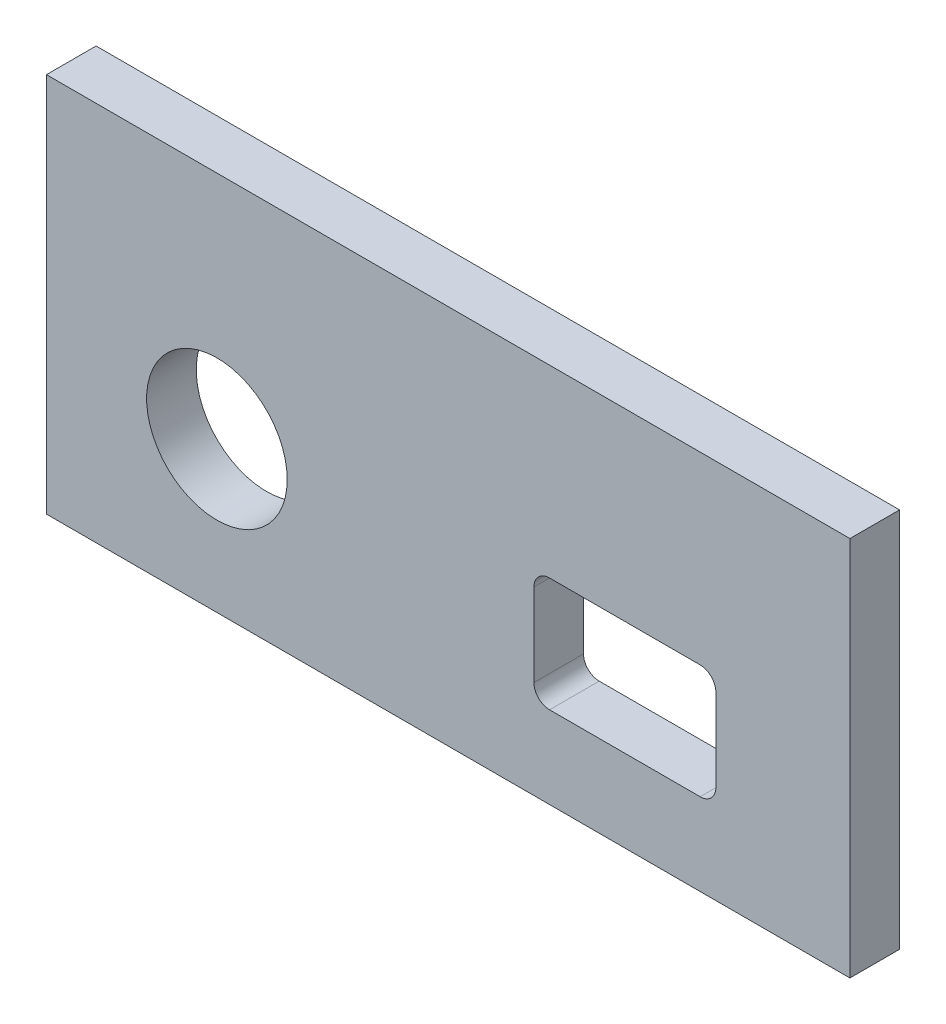
ISO-10303-21;
HEADER;
FILE_DESCRIPTION(('STEP AP214'),'2;1');
FILE_NAME('part.step','',(''),(''),'','','');
FILE_SCHEMA(('AUTOMOTIVE_DESIGN { 1 0 10303 214 1 1 1 1 }'));
ENDSEC;
DATA;
#1=APPLICATION_CONTEXT('core data for automotive mechanical design processes');
#2=APPLICATION_PROTOCOL_DEFINITION('international standard','automotive_design',2000,#1);
#3=PRODUCT_CONTEXT('',#1,'mechanical');
#4=PRODUCT('Part','Part','',(#3));
#5=PRODUCT_RELATED_PRODUCT_CATEGORY('part','',(#4));
#6=PRODUCT_DEFINITION_FORMATION('','',#4);
#7=PRODUCT_DEFINITION_CONTEXT('part definition',#1,'design');
#8=PRODUCT_DEFINITION('design','',#6,#7);
#9=PRODUCT_DEFINITION_SHAPE('','',#8);
#10=(LENGTH_UNIT() NAMED_UNIT(*) SI_UNIT(.MILLI.,.METRE.));
#11=(NAMED_UNIT(*) PLANE_ANGLE_UNIT() SI_UNIT($,.RADIAN.));
#12=(NAMED_UNIT(*) SI_UNIT($,.STERADIAN.) SOLID_ANGLE_UNIT());
#13=UNCERTAINTY_MEASURE_WITH_UNIT(LENGTH_MEASURE(1.E-05),#10,'distance_accuracy_value','');
#14=(GEOMETRIC_REPRESENTATION_CONTEXT(3) GLOBAL_UNCERTAINTY_ASSIGNED_CONTEXT((#13)) GLOBAL_UNIT_ASSIGNED_CONTEXT((#10,
#11,#12)) REPRESENTATION_CONTEXT('',''));
#15=CARTESIAN_POINT('',(0.,0.,0.));
#16=DIRECTION('',(0.,0.,1.));
#17=DIRECTION('',(1.,0.,0.));
#18=AXIS2_PLACEMENT_3D('',#15,#16,#17);
#19=CARTESIAN_POINT('',(0.,0.,79.0305319551957));
#20=DIRECTION('',(0.,0.,1.));
#21=DIRECTION('',(1.,0.,0.));
#22=AXIS2_PLACEMENT_3D('',#19,#20,#21);
#23=PLANE('',#22);
#24=DIRECTION('',(0.,-1.,0.));
#25=VECTOR('',#24,1.);
#26=CARTESIAN_POINT('',(8.35773221474386,44.8268255638794,79.0305319551957));
#27=LINE('',#26,#25);
#28=CARTESIAN_POINT('',(8.35773221474386,44.8268255638794,79.0305319551957));
#29=VERTEX_POINT('',#28);
#30=CARTESIAN_POINT('',(8.35773221474386,21.8232894382297,79.0305319551957));
#31=VERTEX_POINT('',#30);
#32=EDGE_CURVE('E192',#29,#31,#27,.T.);
#33=ORIENTED_EDGE('',*,*,#32,.T.);
#34=DIRECTION('',(1.,0.,0.));
#35=VECTOR('',#34,1.);
#36=CARTESIAN_POINT('',(8.35773221474386,21.8232894382297,79.0305319551957));
#37=LINE('',#36,#35);
#38=CARTESIAN_POINT('',(56.9215256107525,21.8232894382297,79.0305319551957));
#39=VERTEX_POINT('',#38);
#40=EDGE_CURVE('E195',#31,#39,#37,.T.);
#41=ORIENTED_EDGE('',*,*,#40,.T.);
#42=DIRECTION('',(0.,1.,0.));
#43=VECTOR('',#42,1.);
#44=CARTESIAN_POINT('',(56.9215256107525,44.8268255638794,79.0305319551957));
#45=LINE('',#44,#43);
#46=CARTESIAN_POINT('',(56.9215256107525,44.8268255638794,79.0305319551957));
#47=VERTEX_POINT('',#46);
#48=EDGE_CURVE('E198',#39,#47,#45,.T.);
#49=ORIENTED_EDGE('',*,*,#48,.T.);
#50=DIRECTION('',(-1.,0.,0.));
#51=VECTOR('',#50,1.);
#52=CARTESIAN_POINT('',(8.35773221474386,44.8268255638794,79.0305319551957));
#53=LINE('',#52,#51);
#54=EDGE_CURVE('E200',#47,#29,#53,.T.);
#55=ORIENTED_EDGE('',*,*,#54,.T.);
#56=EDGE_LOOP('',(#33,#41,#49,#55));
#57=FACE_BOUND('',#56,.T.);
#58=CARTESIAN_POINT('',(18.6608280360299,30.9068255638794,79.0305319551957));
#59=DIRECTION('',(0.,0.,1.));
#60=DIRECTION('',(1.,0.,0.));
#61=AXIS2_PLACEMENT_3D('',#58,#59,#60);
#62=CIRCLE('',#61,4.25);
#63=CARTESIAN_POINT('',(22.9108280360299,30.9068255638794,79.0305319551957));
#64=VERTEX_POINT('',#63);
#65=EDGE_CURVE('E186',#64,#64,#62,.T.);
#66=ORIENTED_EDGE('',*,*,#65,.F.);
#67=EDGE_LOOP('',(#66));
#68=FACE_BOUND('',#67,.T.);
#69=DIRECTION('',(0.,-1.,0.));
#70=VECTOR('',#69,1.);
#71=CARTESIAN_POINT('',(37.8185984208187,32.7358519521624,79.0305319551957));
#72=LINE('',#71,#70);
#73=CARTESIAN_POINT('',(37.8185984208187,32.7358519521624,79.0305319551957));
#74=VERTEX_POINT('',#73);
#75=CARTESIAN_POINT('',(37.8185984208187,27.7358519521624,79.0305319551957));
#76=VERTEX_POINT('',#75);
#77=EDGE_CURVE('E129',#74,#76,#72,.T.);
#78=ORIENTED_EDGE('',*,*,#77,.F.);
#79=CARTESIAN_POINT('',(38.7685984208187,32.7358519521624,79.0305319551957));
#80=DIRECTION('',(0.,0.,1.));
#81=DIRECTION('',(1.,0.,0.));
#82=AXIS2_PLACEMENT_3D('',#79,#80,#81);
#83=CIRCLE('',#82,0.95);
#84=CARTESIAN_POINT('',(38.7685984208187,33.6858519521624,79.0305319551957));
#85=VERTEX_POINT('',#84);
#86=EDGE_CURVE('E121',#85,#74,#83,.T.);
#87=ORIENTED_EDGE('',*,*,#86,.F.);
#88=DIRECTION('',(-1.,0.,0.));
#89=VECTOR('',#88,1.);
#90=CARTESIAN_POINT('',(47.8685984208187,33.6858519521624,79.0305319551957));
#91=LINE('',#90,#89);
#92=CARTESIAN_POINT('',(47.8685984208187,33.6858519521624,79.0305319551957));
#93=VERTEX_POINT('',#92);
#94=EDGE_CURVE('E154',#93,#85,#91,.T.);
#95=ORIENTED_EDGE('',*,*,#94,.F.);
#96=CARTESIAN_POINT('',(47.8685984208187,32.7358519521624,79.0305319551957));
#97=DIRECTION('',(0.,0.,1.));
#98=DIRECTION('',(1.,0.,0.));
#99=AXIS2_PLACEMENT_3D('',#96,#97,#98);
#100=CIRCLE('',#99,0.95);
#101=CARTESIAN_POINT('',(48.8185984208187,32.7358519521624,79.0305319551957));
#102=VERTEX_POINT('',#101);
#103=EDGE_CURVE('E152',#102,#93,#100,.T.);
#104=ORIENTED_EDGE('',*,*,#103,.F.);
#105=DIRECTION('',(0.,1.,0.));
#106=VECTOR('',#105,1.);
#107=CARTESIAN_POINT('',(48.8185984208187,27.7358519521624,79.0305319551957));
#108=LINE('',#107,#106);
#109=CARTESIAN_POINT('',(48.8185984208187,27.7358519521624,79.0305319551957));
#110=VERTEX_POINT('',#109);
#111=EDGE_CURVE('E150',#110,#102,#108,.T.);
#112=ORIENTED_EDGE('',*,*,#111,.F.);
#113=CARTESIAN_POINT('',(47.8685984208187,27.7358519521624,79.0305319551957));
#114=DIRECTION('',(0.,0.,1.));
#115=DIRECTION('',(1.,0.,0.));
#116=AXIS2_PLACEMENT_3D('',#113,#114,#115);
#117=CIRCLE('',#116,0.95);
#118=CARTESIAN_POINT('',(47.8685984208187,26.7858519521624,79.0305319551957));
#119=VERTEX_POINT('',#118);
#120=EDGE_CURVE('E148',#119,#110,#117,.T.);
#121=ORIENTED_EDGE('',*,*,#120,.F.);
#122=DIRECTION('',(1.,0.,0.));
#123=VECTOR('',#122,1.);
#124=CARTESIAN_POINT('',(38.7685984208187,26.7858519521624,79.0305319551957));
#125=LINE('',#124,#123);
#126=CARTESIAN_POINT('',(38.7685984208187,26.7858519521624,79.0305319551957));
#127=VERTEX_POINT('',#126);
#128=EDGE_CURVE('E144',#127,#119,#125,.T.);
#129=ORIENTED_EDGE('',*,*,#128,.F.);
#130=CARTESIAN_POINT('',(38.7685984208187,27.7358519521624,79.0305319551957));
#131=DIRECTION('',(0.,0.,1.));
#132=DIRECTION('',(1.,0.,0.));
#133=AXIS2_PLACEMENT_3D('',#130,#131,#132);
#134=CIRCLE('',#133,0.95);
#135=EDGE_CURVE('E142',#76,#127,#134,.T.);
#136=ORIENTED_EDGE('',*,*,#135,.F.);
#137=EDGE_LOOP('',(#78,#87,#95,#104,#112,#121,#129,#136));
#138=FACE_BOUND('',#137,.T.);
#139=ADVANCED_FACE('F32',(#57,#68,#138),#23,.T.);
#140=CARTESIAN_POINT('',(0.,0.,76.0305319551957));
#141=DIRECTION('',(0.,0.,1.));
#142=DIRECTION('',(1.,0.,0.));
#143=AXIS2_PLACEMENT_3D('',#140,#141,#142);
#144=PLANE('',#143);
#145=CARTESIAN_POINT('',(18.6608280360299,30.9068255638794,76.0305319551957));
#146=DIRECTION('',(0.,0.,1.));
#147=DIRECTION('',(1.,0.,0.));
#148=AXIS2_PLACEMENT_3D('',#145,#146,#147);
#149=CIRCLE('',#148,4.25);
#150=CARTESIAN_POINT('',(22.9108280360299,30.9068255638794,76.0305319551957));
#151=VERTEX_POINT('',#150);
#152=EDGE_CURVE('E137',#151,#151,#149,.T.);
#153=ORIENTED_EDGE('',*,*,#152,.T.);
#154=EDGE_LOOP('',(#153));
#155=FACE_BOUND('',#154,.T.);
#156=DIRECTION('',(0.,-1.,0.));
#157=VECTOR('',#156,1.);
#158=CARTESIAN_POINT('',(8.35773221474386,44.8268255638794,76.0305319551957));
#159=LINE('',#158,#157);
#160=CARTESIAN_POINT('',(8.35773221474386,44.8268255638794,76.0305319551957));
#161=VERTEX_POINT('',#160);
#162=CARTESIAN_POINT('',(8.35773221474386,21.8232894382297,76.0305319551957));
#163=VERTEX_POINT('',#162);
#164=EDGE_CURVE('E189',#161,#163,#159,.T.);
#165=ORIENTED_EDGE('',*,*,#164,.F.);
#166=DIRECTION('',(-1.,0.,0.));
#167=VECTOR('',#166,1.);
#168=CARTESIAN_POINT('',(8.35773221474386,44.8268255638794,76.0305319551957));
#169=LINE('',#168,#167);
#170=CARTESIAN_POINT('',(56.9215256107525,44.8268255638794,76.0305319551957));
#171=VERTEX_POINT('',#170);
#172=EDGE_CURVE('E196',#171,#161,#169,.T.);
#173=ORIENTED_EDGE('',*,*,#172,.F.);
#174=DIRECTION('',(0.,1.,0.));
#175=VECTOR('',#174,1.);
#176=CARTESIAN_POINT('',(56.9215256107525,44.8268255638794,76.0305319551957));
#177=LINE('',#176,#175);
#178=CARTESIAN_POINT('',(56.9215256107525,21.8232894382297,76.0305319551957));
#179=VERTEX_POINT('',#178);
#180=EDGE_CURVE('E207',#179,#171,#177,.T.);
#181=ORIENTED_EDGE('',*,*,#180,.F.);
#182=DIRECTION('',(1.,0.,0.));
#183=VECTOR('',#182,1.);
#184=CARTESIAN_POINT('',(8.35773221474386,21.8232894382297,76.0305319551957));
#185=LINE('',#184,#183);
#186=EDGE_CURVE('E205',#163,#179,#185,.T.);
#187=ORIENTED_EDGE('',*,*,#186,.F.);
#188=EDGE_LOOP('',(#165,#173,#181,#187));
#189=FACE_BOUND('',#188,.T.);
#190=CARTESIAN_POINT('',(38.7685984208187,32.7358519521624,76.0305319551957));
#191=DIRECTION('',(0.,0.,1.));
#192=DIRECTION('',(1.,0.,0.));
#193=AXIS2_PLACEMENT_3D('',#190,#191,#192);
#194=CIRCLE('',#193,0.95);
#195=CARTESIAN_POINT('',(38.7685984208187,33.6858519521624,76.0305319551957));
#196=VERTEX_POINT('',#195);
#197=CARTESIAN_POINT('',(37.8185984208187,32.7358519521624,76.0305319551957));
#198=VERTEX_POINT('',#197);
#199=EDGE_CURVE('E55',#196,#198,#194,.T.);
#200=ORIENTED_EDGE('',*,*,#199,.T.);
#201=DIRECTION('',(0.,-1.,0.));
#202=VECTOR('',#201,1.);
#203=CARTESIAN_POINT('',(37.8185984208187,32.7358519521624,76.0305319551957));
#204=LINE('',#203,#202);
#205=CARTESIAN_POINT('',(37.8185984208187,27.7358519521624,76.0305319551957));
#206=VERTEX_POINT('',#205);
#207=EDGE_CURVE('E136',#198,#206,#204,.T.);
#208=ORIENTED_EDGE('',*,*,#207,.T.);
#209=CARTESIAN_POINT('',(38.7685984208187,27.7358519521624,76.0305319551957));
#210=DIRECTION('',(0.,0.,1.));
#211=DIRECTION('',(1.,0.,0.));
#212=AXIS2_PLACEMENT_3D('',#209,#210,#211);
#213=CIRCLE('',#212,0.95);
#214=CARTESIAN_POINT('',(38.7685984208187,26.7858519521624,76.0305319551957));
#215=VERTEX_POINT('',#214);
#216=EDGE_CURVE('E158',#206,#215,#213,.T.);
#217=ORIENTED_EDGE('',*,*,#216,.T.);
#218=DIRECTION('',(1.,0.,0.));
#219=VECTOR('',#218,1.);
#220=CARTESIAN_POINT('',(38.7685984208187,26.7858519521624,76.0305319551957));
#221=LINE('',#220,#219);
#222=CARTESIAN_POINT('',(47.8685984208187,26.7858519521624,76.0305319551957));
#223=VERTEX_POINT('',#222);
#224=EDGE_CURVE('E161',#215,#223,#221,.T.);
#225=ORIENTED_EDGE('',*,*,#224,.T.);
#226=CARTESIAN_POINT('',(47.8685984208187,27.7358519521624,76.0305319551957));
#227=DIRECTION('',(0.,0.,1.));
#228=DIRECTION('',(1.,0.,0.));
#229=AXIS2_PLACEMENT_3D('',#226,#227,#228);
#230=CIRCLE('',#229,0.95);
#231=CARTESIAN_POINT('',(48.8185984208187,27.7358519521624,76.0305319551957));
#232=VERTEX_POINT('',#231);
#233=EDGE_CURVE('E164',#223,#232,#230,.T.);
#234=ORIENTED_EDGE('',*,*,#233,.T.);
#235=DIRECTION('',(0.,1.,0.));
#236=VECTOR('',#235,1.);
#237=CARTESIAN_POINT('',(48.8185984208187,27.7358519521624,76.0305319551957));
#238=LINE('',#237,#236);
#239=CARTESIAN_POINT('',(48.8185984208187,32.7358519521624,76.0305319551957));
#240=VERTEX_POINT('',#239);
#241=EDGE_CURVE('E167',#232,#240,#238,.T.);
#242=ORIENTED_EDGE('',*,*,#241,.T.);
#243=CARTESIAN_POINT('',(47.8685984208187,32.7358519521624,76.0305319551957));
#244=DIRECTION('',(0.,0.,1.));
#245=DIRECTION('',(1.,0.,0.));
#246=AXIS2_PLACEMENT_3D('',#243,#244,#245);
#247=CIRCLE('',#246,0.95);
#248=CARTESIAN_POINT('',(47.8685984208187,33.6858519521624,76.0305319551957));
#249=VERTEX_POINT('',#248);
#250=EDGE_CURVE('E170',#240,#249,#247,.T.);
#251=ORIENTED_EDGE('',*,*,#250,.T.);
#252=DIRECTION('',(-1.,0.,0.));
#253=VECTOR('',#252,1.);
#254=CARTESIAN_POINT('',(47.8685984208187,33.6858519521624,76.0305319551957));
#255=LINE('',#254,#253);
#256=EDGE_CURVE('E130',#249,#196,#255,.T.);
#257=ORIENTED_EDGE('',*,*,#256,.T.);
#258=EDGE_LOOP('',(#200,#208,#217,#225,#234,#242,#251,#257));
#259=FACE_BOUND('',#258,.T.);
#260=ADVANCED_FACE('F225',(#155,#189,#259),#144,.F.);
#261=CARTESIAN_POINT('',(8.35773221474386,44.8268255638794,79.0305319551957));
#262=DIRECTION('',(1.,0.,0.));
#263=DIRECTION('',(0.,1.,0.));
#264=AXIS2_PLACEMENT_3D('',#261,#262,#263);
#265=PLANE('',#264);
#266=ORIENTED_EDGE('',*,*,#164,.T.);
#267=DIRECTION('',(0.,0.,-1.));
#268=VECTOR('',#267,1.);
#269=CARTESIAN_POINT('',(8.35773221474386,21.8232894382297,79.0305319551957));
#270=LINE('',#269,#268);
#271=EDGE_CURVE('E11',#31,#163,#270,.T.);
#272=ORIENTED_EDGE('',*,*,#271,.F.);
#273=ORIENTED_EDGE('',*,*,#32,.F.);
#274=DIRECTION('',(0.,0.,-1.));
#275=VECTOR('',#274,1.);
#276=CARTESIAN_POINT('',(8.35773221474386,44.8268255638794,79.0305319551957));
#277=LINE('',#276,#275);
#278=EDGE_CURVE('E202',#29,#161,#277,.T.);
#279=ORIENTED_EDGE('',*,*,#278,.T.);
#280=EDGE_LOOP('',(#266,#272,#273,#279));
#281=FACE_BOUND('',#280,.T.);
#282=ADVANCED_FACE('F34',(#281),#265,.F.);
#283=CARTESIAN_POINT('',(8.35773221474386,21.8232894382297,79.0305319551957));
#284=DIRECTION('',(0.,1.,0.));
#285=DIRECTION('',(0.,0.,1.));
#286=AXIS2_PLACEMENT_3D('',#283,#284,#285);
#287=PLANE('',#286);
#288=ORIENTED_EDGE('',*,*,#186,.T.);
#289=DIRECTION('',(0.,0.,-1.));
#290=VECTOR('',#289,1.);
#291=CARTESIAN_POINT('',(56.9215256107525,21.8232894382297,79.0305319551957));
#292=LINE('',#291,#290);
#293=EDGE_CURVE('E40',#39,#179,#292,.T.);
#294=ORIENTED_EDGE('',*,*,#293,.F.);
#295=ORIENTED_EDGE('',*,*,#40,.F.);
#296=ORIENTED_EDGE('',*,*,#271,.T.);
#297=EDGE_LOOP('',(#288,#294,#295,#296));
#298=FACE_BOUND('',#297,.T.);
#299=ADVANCED_FACE('F236',(#298),#287,.F.);
#300=CARTESIAN_POINT('',(56.9215256107525,44.8268255638794,79.0305319551957));
#301=DIRECTION('',(-1.,0.,0.));
#302=DIRECTION('',(0.,-1.,0.));
#303=AXIS2_PLACEMENT_3D('',#300,#301,#302);
#304=PLANE('',#303);
#305=ORIENTED_EDGE('',*,*,#180,.T.);
#306=DIRECTION('',(0.,0.,-1.));
#307=VECTOR('',#306,1.);
#308=CARTESIAN_POINT('',(56.9215256107525,44.8268255638794,79.0305319551957));
#309=LINE('',#308,#307);
#310=EDGE_CURVE('E212',#47,#171,#309,.T.);
#311=ORIENTED_EDGE('',*,*,#310,.F.);
#312=ORIENTED_EDGE('',*,*,#48,.F.);
#313=ORIENTED_EDGE('',*,*,#293,.T.);
#314=EDGE_LOOP('',(#305,#311,#312,#313));
#315=FACE_BOUND('',#314,.T.);
#316=ADVANCED_FACE('F219',(#315),#304,.F.);
#317=CARTESIAN_POINT('',(8.35773221474386,44.8268255638794,79.0305319551957));
#318=DIRECTION('',(0.,-1.,0.));
#319=DIRECTION('',(0.,0.,-1.));
#320=AXIS2_PLACEMENT_3D('',#317,#318,#319);
#321=PLANE('',#320);
#322=ORIENTED_EDGE('',*,*,#172,.T.);
#323=ORIENTED_EDGE('',*,*,#278,.F.);
#324=ORIENTED_EDGE('',*,*,#54,.F.);
#325=ORIENTED_EDGE('',*,*,#310,.T.);
#326=EDGE_LOOP('',(#322,#323,#324,#325));
#327=FACE_BOUND('',#326,.T.);
#328=ADVANCED_FACE('F229',(#327),#321,.F.);
#329=CARTESIAN_POINT('',(18.6608280360299,30.9068255638794,79.0305319551957));
#330=DIRECTION('',(0.,0.,-1.));
#331=DIRECTION('',(-1.,0.,0.));
#332=AXIS2_PLACEMENT_3D('',#329,#330,#331);
#333=CYLINDRICAL_SURFACE('',#332,4.25);
#334=ORIENTED_EDGE('',*,*,#65,.T.);
#335=EDGE_LOOP('',(#334));
#336=FACE_BOUND('',#335,.T.);
#337=ORIENTED_EDGE('',*,*,#152,.F.);
#338=EDGE_LOOP('',(#337));
#339=FACE_BOUND('',#338,.T.);
#340=ADVANCED_FACE('F251',(#336,#339),#333,.F.);
#341=CARTESIAN_POINT('',(38.7685984208187,32.7358519521624,79.0305319551957));
#342=DIRECTION('',(0.,0.,-1.));
#343=DIRECTION('',(-1.,0.,0.));
#344=AXIS2_PLACEMENT_3D('',#341,#342,#343);
#345=CYLINDRICAL_SURFACE('',#344,0.95);
#346=ORIENTED_EDGE('',*,*,#199,.F.);
#347=DIRECTION('',(0.,0.,-1.));
#348=VECTOR('',#347,1.);
#349=CARTESIAN_POINT('',(38.7685984208187,33.6858519521624,79.0305319551957));
#350=LINE('',#349,#348);
#351=EDGE_CURVE('E125',#85,#196,#350,.T.);
#352=ORIENTED_EDGE('',*,*,#351,.F.);
#353=ORIENTED_EDGE('',*,*,#86,.T.);
#354=DIRECTION('',(0.,0.,-1.));
#355=VECTOR('',#354,1.);
#356=CARTESIAN_POINT('',(37.8185984208187,32.7358519521624,79.0305319551957));
#357=LINE('',#356,#355);
#358=EDGE_CURVE('E124',#74,#198,#357,.T.);
#359=ORIENTED_EDGE('',*,*,#358,.T.);
#360=EDGE_LOOP('',(#346,#352,#353,#359));
#361=FACE_BOUND('',#360,.T.);
#362=ADVANCED_FACE('F123',(#361),#345,.F.);
#363=CARTESIAN_POINT('',(37.8185984208187,32.7358519521624,79.0305319551957));
#364=DIRECTION('',(1.,0.,0.));
#365=DIRECTION('',(0.,0.,-1.));
#366=AXIS2_PLACEMENT_3D('',#363,#364,#365);
#367=PLANE('',#366);
#368=ORIENTED_EDGE('',*,*,#207,.F.);
#369=ORIENTED_EDGE('',*,*,#358,.F.);
#370=ORIENTED_EDGE('',*,*,#77,.T.);
#371=DIRECTION('',(0.,0.,-1.));
#372=VECTOR('',#371,1.);
#373=CARTESIAN_POINT('',(37.8185984208187,27.7358519521624,79.0305319551957));
#374=LINE('',#373,#372);
#375=EDGE_CURVE('E138',#76,#206,#374,.T.);
#376=ORIENTED_EDGE('',*,*,#375,.T.);
#377=EDGE_LOOP('',(#368,#369,#370,#376));
#378=FACE_BOUND('',#377,.T.);
#379=ADVANCED_FACE('F133',(#378),#367,.T.);
#380=CARTESIAN_POINT('',(38.7685984208187,27.7358519521624,79.0305319551957));
#381=DIRECTION('',(0.,0.,-1.));
#382=DIRECTION('',(-1.,0.,0.));
#383=AXIS2_PLACEMENT_3D('',#380,#381,#382);
#384=CYLINDRICAL_SURFACE('',#383,0.95);
#385=ORIENTED_EDGE('',*,*,#216,.F.);
#386=ORIENTED_EDGE('',*,*,#375,.F.);
#387=ORIENTED_EDGE('',*,*,#135,.T.);
#388=DIRECTION('',(0.,0.,-1.));
#389=VECTOR('',#388,1.);
#390=CARTESIAN_POINT('',(38.7685984208187,26.7858519521624,79.0305319551957));
#391=LINE('',#390,#389);
#392=EDGE_CURVE('E183',#127,#215,#391,.T.);
#393=ORIENTED_EDGE('',*,*,#392,.T.);
#394=EDGE_LOOP('',(#385,#386,#387,#393));
#395=FACE_BOUND('',#394,.T.);
#396=ADVANCED_FACE('F268',(#395),#384,.F.);
#397=CARTESIAN_POINT('',(38.7685984208187,26.7858519521624,79.0305319551957));
#398=DIRECTION('',(0.,1.,0.));
#399=DIRECTION('',(0.,0.,1.));
#400=AXIS2_PLACEMENT_3D('',#397,#398,#399);
#401=PLANE('',#400);
#402=ORIENTED_EDGE('',*,*,#224,.F.);
#403=ORIENTED_EDGE('',*,*,#392,.F.);
#404=ORIENTED_EDGE('',*,*,#128,.T.);
#405=DIRECTION('',(0.,0.,-1.));
#406=VECTOR('',#405,1.);
#407=CARTESIAN_POINT('',(47.8685984208187,26.7858519521624,79.0305319551957));
#408=LINE('',#407,#406);
#409=EDGE_CURVE('E181',#119,#223,#408,.T.);
#410=ORIENTED_EDGE('',*,*,#409,.T.);
#411=EDGE_LOOP('',(#402,#403,#404,#410));
#412=FACE_BOUND('',#411,.T.);
#413=ADVANCED_FACE('F273',(#412),#401,.T.);
#414=CARTESIAN_POINT('',(47.8685984208187,27.7358519521624,79.0305319551957));
#415=DIRECTION('',(0.,0.,-1.));
#416=DIRECTION('',(-1.,0.,0.));
#417=AXIS2_PLACEMENT_3D('',#414,#415,#416);
#418=CYLINDRICAL_SURFACE('',#417,0.95);
#419=ORIENTED_EDGE('',*,*,#233,.F.);
#420=ORIENTED_EDGE('',*,*,#409,.F.);
#421=ORIENTED_EDGE('',*,*,#120,.T.);
#422=DIRECTION('',(0.,0.,-1.));
#423=VECTOR('',#422,1.);
#424=CARTESIAN_POINT('',(48.8185984208187,27.7358519521624,79.0305319551957));
#425=LINE('',#424,#423);
#426=EDGE_CURVE('E179',#110,#232,#425,.T.);
#427=ORIENTED_EDGE('',*,*,#426,.T.);
#428=EDGE_LOOP('',(#419,#420,#421,#427));
#429=FACE_BOUND('',#428,.T.);
#430=ADVANCED_FACE('F277',(#429),#418,.F.);
#431=CARTESIAN_POINT('',(48.8185984208187,27.7358519521624,79.0305319551957));
#432=DIRECTION('',(-1.,0.,0.));
#433=DIRECTION('',(0.,0.,1.));
#434=AXIS2_PLACEMENT_3D('',#431,#432,#433);
#435=PLANE('',#434);
#436=ORIENTED_EDGE('',*,*,#241,.F.);
#437=ORIENTED_EDGE('',*,*,#426,.F.);
#438=ORIENTED_EDGE('',*,*,#111,.T.);
#439=DIRECTION('',(0.,0.,-1.));
#440=VECTOR('',#439,1.);
#441=CARTESIAN_POINT('',(48.8185984208187,32.7358519521624,79.0305319551957));
#442=LINE('',#441,#440);
#443=EDGE_CURVE('E177',#102,#240,#442,.T.);
#444=ORIENTED_EDGE('',*,*,#443,.T.);
#445=EDGE_LOOP('',(#436,#437,#438,#444));
#446=FACE_BOUND('',#445,.T.);
#447=ADVANCED_FACE('F281',(#446),#435,.T.);
#448=CARTESIAN_POINT('',(47.8685984208187,32.7358519521624,79.0305319551957));
#449=DIRECTION('',(0.,0.,-1.));
#450=DIRECTION('',(-1.,0.,0.));
#451=AXIS2_PLACEMENT_3D('',#448,#449,#450);
#452=CYLINDRICAL_SURFACE('',#451,0.95);
#453=ORIENTED_EDGE('',*,*,#250,.F.);
#454=ORIENTED_EDGE('',*,*,#443,.F.);
#455=ORIENTED_EDGE('',*,*,#103,.T.);
#456=DIRECTION('',(0.,0.,-1.));
#457=VECTOR('',#456,1.);
#458=CARTESIAN_POINT('',(47.8685984208187,33.6858519521624,79.0305319551957));
#459=LINE('',#458,#457);
#460=EDGE_CURVE('E47',#93,#249,#459,.T.);
#461=ORIENTED_EDGE('',*,*,#460,.T.);
#462=EDGE_LOOP('',(#453,#454,#455,#461));
#463=FACE_BOUND('',#462,.T.);
#464=ADVANCED_FACE('F285',(#463),#452,.F.);
#465=CARTESIAN_POINT('',(47.8685984208187,33.6858519521624,79.0305319551957));
#466=DIRECTION('',(0.,-1.,0.));
#467=DIRECTION('',(0.,0.,-1.));
#468=AXIS2_PLACEMENT_3D('',#465,#466,#467);
#469=PLANE('',#468);
#470=ORIENTED_EDGE('',*,*,#256,.F.);
#471=ORIENTED_EDGE('',*,*,#460,.F.);
#472=ORIENTED_EDGE('',*,*,#94,.T.);
#473=ORIENTED_EDGE('',*,*,#351,.T.);
#474=EDGE_LOOP('',(#470,#471,#472,#473));
#475=FACE_BOUND('',#474,.T.);
#476=ADVANCED_FACE('F289',(#475),#469,.T.);
#477=CLOSED_SHELL('',(#139,#260,#282,#299,#316,#328,#340,#362,#379,#396,#413,#430,#447,#464,#476));
#478=MANIFOLD_SOLID_BREP('B2',#477);
#479=ADVANCED_BREP_SHAPE_REPRESENTATION('',(#18,#478),#14);
#480=SHAPE_DEFINITION_REPRESENTATION(#9,#479);
ENDSEC;
END-ISO-10303-21;
